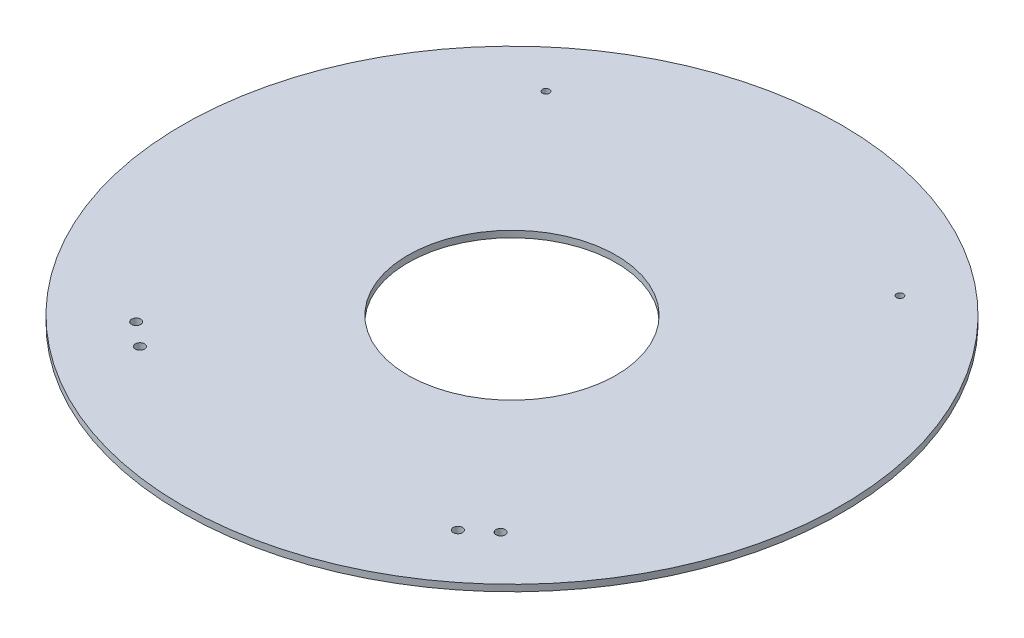
ISO-10303-21;
HEADER;
FILE_DESCRIPTION(('STEP AP214'),'2;1');
FILE_NAME('part.step','',(''),(''),'','','');
FILE_SCHEMA(('AUTOMOTIVE_DESIGN { 1 0 10303 214 1 1 1 1 }'));
ENDSEC;
DATA;
#1=APPLICATION_CONTEXT('core data for automotive mechanical design processes');
#2=APPLICATION_PROTOCOL_DEFINITION('international standard','automotive_design',2000,#1);
#3=PRODUCT_CONTEXT('',#1,'mechanical');
#4=PRODUCT('Part','Part','',(#3));
#5=PRODUCT_RELATED_PRODUCT_CATEGORY('part','',(#4));
#6=PRODUCT_DEFINITION_FORMATION('','',#4);
#7=PRODUCT_DEFINITION_CONTEXT('part definition',#1,'design');
#8=PRODUCT_DEFINITION('design','',#6,#7);
#9=PRODUCT_DEFINITION_SHAPE('','',#8);
#10=(LENGTH_UNIT() NAMED_UNIT(*) SI_UNIT(.MILLI.,.METRE.));
#11=(NAMED_UNIT(*) PLANE_ANGLE_UNIT() SI_UNIT($,.RADIAN.));
#12=(NAMED_UNIT(*) SI_UNIT($,.STERADIAN.) SOLID_ANGLE_UNIT());
#13=UNCERTAINTY_MEASURE_WITH_UNIT(LENGTH_MEASURE(1.E-05),#10,'distance_accuracy_value','');
#14=(GEOMETRIC_REPRESENTATION_CONTEXT(3) GLOBAL_UNCERTAINTY_ASSIGNED_CONTEXT((#13)) GLOBAL_UNIT_ASSIGNED_CONTEXT((#10,
#11,#12)) REPRESENTATION_CONTEXT('',''));
#15=CARTESIAN_POINT('',(0.,0.,0.));
#16=DIRECTION('',(0.,0.,1.));
#17=DIRECTION('',(1.,0.,0.));
#18=AXIS2_PLACEMENT_3D('',#15,#16,#17);
#19=CARTESIAN_POINT('',(0.,4.7625,0.));
#20=DIRECTION('',(0.,1.,0.));
#21=DIRECTION('',(0.,0.,1.));
#22=AXIS2_PLACEMENT_3D('',#19,#20,#21);
#23=PLANE('',#22);
#24=CARTESIAN_POINT('',(129.594016957928,4.7625,-154.444135288325));
#25=DIRECTION('',(0.,-1.,0.));
#26=DIRECTION('',(0.,0.,-1.));
#27=AXIS2_PLACEMENT_3D('',#24,#25,#26);
#28=CIRCLE('',#27,2.55269999999999);
#29=CARTESIAN_POINT('',(129.594016957928,4.7625,-156.996835288325));
#30=VERTEX_POINT('',#29);
#31=EDGE_CURVE('E97',#30,#30,#28,.T.);
#32=ORIENTED_EDGE('',*,*,#31,.T.);
#33=EDGE_LOOP('',(#32));
#34=FACE_BOUND('',#33,.T.);
#35=CARTESIAN_POINT('',(0.,4.7625,0.));
#36=DIRECTION('',(0.,1.,0.));
#37=DIRECTION('',(0.,0.,1.));
#38=AXIS2_PLACEMENT_3D('',#35,#36,#37);
#39=CIRCLE('',#38,76.2);
#40=CARTESIAN_POINT('',(0.,4.7625,76.2));
#41=VERTEX_POINT('',#40);
#42=EDGE_CURVE('E60',#41,#41,#39,.T.);
#43=ORIENTED_EDGE('',*,*,#42,.F.);
#44=EDGE_LOOP('',(#43));
#45=FACE_BOUND('',#44,.T.);
#46=CARTESIAN_POINT('',(0.,4.7625,0.));
#47=DIRECTION('',(0.,1.,0.));
#48=DIRECTION('',(0.,0.,1.));
#49=AXIS2_PLACEMENT_3D('',#46,#47,#48);
#50=CIRCLE('',#49,241.3);
#51=CARTESIAN_POINT('',(0.,4.7625,241.3));
#52=VERTEX_POINT('',#51);
#53=EDGE_CURVE('E12',#52,#52,#50,.T.);
#54=ORIENTED_EDGE('',*,*,#53,.T.);
#55=EDGE_LOOP('',(#54));
#56=FACE_BOUND('',#55,.T.);
#57=CARTESIAN_POINT('',(-133.426417094913,4.7625,141.723430893849));
#58=DIRECTION('',(0.,-1.,0.));
#59=DIRECTION('',(0.,0.,-1.));
#60=AXIS2_PLACEMENT_3D('',#57,#58,#59);
#61=CIRCLE('',#60,3.3782);
#62=CARTESIAN_POINT('',(-133.426417094913,4.7625,138.345230893849));
#63=VERTEX_POINT('',#62);
#64=EDGE_CURVE('E65',#63,#63,#61,.T.);
#65=ORIENTED_EDGE('',*,*,#64,.T.);
#66=EDGE_LOOP('',(#65));
#67=FACE_BOUND('',#66,.T.);
#68=CARTESIAN_POINT('',(-116.401079346594,4.7625,156.009385519133));
#69=DIRECTION('',(0.,-1.,0.));
#70=DIRECTION('',(0.,0.,-1.));
#71=AXIS2_PLACEMENT_3D('',#68,#69,#70);
#72=CIRCLE('',#71,3.3782);
#73=CARTESIAN_POINT('',(-116.401079346594,4.7625,152.631185519133));
#74=VERTEX_POINT('',#73);
#75=EDGE_CURVE('E73',#74,#74,#72,.T.);
#76=ORIENTED_EDGE('',*,*,#75,.T.);
#77=EDGE_LOOP('',(#76));
#78=FACE_BOUND('',#77,.T.);
#79=CARTESIAN_POINT('',(116.401079346594,4.7625,156.009385519133));
#80=DIRECTION('',(0.,-1.,0.));
#81=DIRECTION('',(0.,0.,-1.));
#82=AXIS2_PLACEMENT_3D('',#79,#80,#81);
#83=CIRCLE('',#82,3.3782);
#84=CARTESIAN_POINT('',(116.401079346594,4.7625,152.631185519133));
#85=VERTEX_POINT('',#84);
#86=EDGE_CURVE('E79',#85,#85,#83,.T.);
#87=ORIENTED_EDGE('',*,*,#86,.T.);
#88=EDGE_LOOP('',(#87));
#89=FACE_BOUND('',#88,.T.);
#90=CARTESIAN_POINT('',(133.426417094913,4.7625,141.723430893849));
#91=DIRECTION('',(0.,-1.,0.));
#92=DIRECTION('',(0.,0.,-1.));
#93=AXIS2_PLACEMENT_3D('',#90,#91,#92);
#94=CIRCLE('',#93,3.3782);
#95=CARTESIAN_POINT('',(133.426417094913,4.7625,138.345230893849));
#96=VERTEX_POINT('',#95);
#97=EDGE_CURVE('E85',#96,#96,#94,.T.);
#98=ORIENTED_EDGE('',*,*,#97,.T.);
#99=EDGE_LOOP('',(#98));
#100=FACE_BOUND('',#99,.T.);
#101=CARTESIAN_POINT('',(-129.594016957928,4.7625,-154.444135288325));
#102=DIRECTION('',(0.,-1.,0.));
#103=DIRECTION('',(0.,0.,-1.));
#104=AXIS2_PLACEMENT_3D('',#101,#102,#103);
#105=CIRCLE('',#104,2.55269999999999);
#106=CARTESIAN_POINT('',(-129.594016957928,4.7625,-156.996835288325));
#107=VERTEX_POINT('',#106);
#108=EDGE_CURVE('E91',#107,#107,#105,.T.);
#109=ORIENTED_EDGE('',*,*,#108,.T.);
#110=EDGE_LOOP('',(#109));
#111=FACE_BOUND('',#110,.T.);
#112=ADVANCED_FACE('F49',(#34,#45,#56,#67,#78,#89,#100,#111),#23,.T.);
#113=CARTESIAN_POINT('',(0.,0.,0.));
#114=DIRECTION('',(0.,1.,0.));
#115=DIRECTION('',(0.,0.,1.));
#116=AXIS2_PLACEMENT_3D('',#113,#114,#115);
#117=PLANE('',#116);
#118=CARTESIAN_POINT('',(129.594016957928,0.,-154.444135288325));
#119=DIRECTION('',(0.,-1.,0.));
#120=DIRECTION('',(0.,0.,-1.));
#121=AXIS2_PLACEMENT_3D('',#118,#119,#120);
#122=CIRCLE('',#121,2.55269999999999);
#123=CARTESIAN_POINT('',(129.594016957928,0.,-156.996835288325));
#124=VERTEX_POINT('',#123);
#125=EDGE_CURVE('E100',#124,#124,#122,.T.);
#126=ORIENTED_EDGE('',*,*,#125,.F.);
#127=EDGE_LOOP('',(#126));
#128=FACE_BOUND('',#127,.T.);
#129=CARTESIAN_POINT('',(-129.594016957928,0.,-154.444135288325));
#130=DIRECTION('',(0.,-1.,0.));
#131=DIRECTION('',(0.,0.,-1.));
#132=AXIS2_PLACEMENT_3D('',#129,#130,#131);
#133=CIRCLE('',#132,2.55269999999999);
#134=CARTESIAN_POINT('',(-129.594016957928,0.,-156.996835288325));
#135=VERTEX_POINT('',#134);
#136=EDGE_CURVE('E94',#135,#135,#133,.T.);
#137=ORIENTED_EDGE('',*,*,#136,.F.);
#138=EDGE_LOOP('',(#137));
#139=FACE_BOUND('',#138,.T.);
#140=CARTESIAN_POINT('',(133.426417094913,0.,141.723430893849));
#141=DIRECTION('',(0.,-1.,0.));
#142=DIRECTION('',(0.,0.,-1.));
#143=AXIS2_PLACEMENT_3D('',#140,#141,#142);
#144=CIRCLE('',#143,3.3782);
#145=CARTESIAN_POINT('',(133.426417094913,0.,138.345230893849));
#146=VERTEX_POINT('',#145);
#147=EDGE_CURVE('E88',#146,#146,#144,.T.);
#148=ORIENTED_EDGE('',*,*,#147,.F.);
#149=EDGE_LOOP('',(#148));
#150=FACE_BOUND('',#149,.T.);
#151=CARTESIAN_POINT('',(-116.401079346594,0.,156.009385519133));
#152=DIRECTION('',(0.,-1.,0.));
#153=DIRECTION('',(0.,0.,-1.));
#154=AXIS2_PLACEMENT_3D('',#151,#152,#153);
#155=CIRCLE('',#154,3.3782);
#156=CARTESIAN_POINT('',(-116.401079346594,0.,152.631185519133));
#157=VERTEX_POINT('',#156);
#158=EDGE_CURVE('E76',#157,#157,#155,.T.);
#159=ORIENTED_EDGE('',*,*,#158,.F.);
#160=EDGE_LOOP('',(#159));
#161=FACE_BOUND('',#160,.T.);
#162=CARTESIAN_POINT('',(-133.426417094913,0.,141.723430893849));
#163=DIRECTION('',(0.,-1.,0.));
#164=DIRECTION('',(0.,0.,-1.));
#165=AXIS2_PLACEMENT_3D('',#162,#163,#164);
#166=CIRCLE('',#165,3.3782);
#167=CARTESIAN_POINT('',(-133.426417094913,0.,138.345230893849));
#168=VERTEX_POINT('',#167);
#169=EDGE_CURVE('E70',#168,#168,#166,.T.);
#170=ORIENTED_EDGE('',*,*,#169,.F.);
#171=EDGE_LOOP('',(#170));
#172=FACE_BOUND('',#171,.T.);
#173=CARTESIAN_POINT('',(0.,0.,0.));
#174=DIRECTION('',(0.,1.,0.));
#175=DIRECTION('',(0.,0.,1.));
#176=AXIS2_PLACEMENT_3D('',#173,#174,#175);
#177=CIRCLE('',#176,241.3);
#178=CARTESIAN_POINT('',(0.,0.,241.3));
#179=VERTEX_POINT('',#178);
#180=EDGE_CURVE('E53',#179,#179,#177,.T.);
#181=ORIENTED_EDGE('',*,*,#180,.F.);
#182=EDGE_LOOP('',(#181));
#183=FACE_BOUND('',#182,.T.);
#184=CARTESIAN_POINT('',(0.,0.,0.));
#185=DIRECTION('',(0.,1.,0.));
#186=DIRECTION('',(0.,0.,1.));
#187=AXIS2_PLACEMENT_3D('',#184,#185,#186);
#188=CIRCLE('',#187,76.2);
#189=CARTESIAN_POINT('',(0.,0.,76.2));
#190=VERTEX_POINT('',#189);
#191=EDGE_CURVE('E62',#190,#190,#188,.T.);
#192=ORIENTED_EDGE('',*,*,#191,.T.);
#193=EDGE_LOOP('',(#192));
#194=FACE_BOUND('',#193,.T.);
#195=CARTESIAN_POINT('',(116.401079346594,0.,156.009385519133));
#196=DIRECTION('',(0.,-1.,0.));
#197=DIRECTION('',(0.,0.,-1.));
#198=AXIS2_PLACEMENT_3D('',#195,#196,#197);
#199=CIRCLE('',#198,3.3782);
#200=CARTESIAN_POINT('',(116.401079346594,0.,152.631185519133));
#201=VERTEX_POINT('',#200);
#202=EDGE_CURVE('E82',#201,#201,#199,.T.);
#203=ORIENTED_EDGE('',*,*,#202,.F.);
#204=EDGE_LOOP('',(#203));
#205=FACE_BOUND('',#204,.T.);
#206=ADVANCED_FACE('F106',(#128,#139,#150,#161,#172,#183,#194,#205),#117,.F.);
#207=CARTESIAN_POINT('',(0.,4.7625,0.));
#208=DIRECTION('',(0.,-1.,0.));
#209=DIRECTION('',(0.,0.,-1.));
#210=AXIS2_PLACEMENT_3D('',#207,#208,#209);
#211=CYLINDRICAL_SURFACE('',#210,241.3);
#212=ORIENTED_EDGE('',*,*,#53,.F.);
#213=EDGE_LOOP('',(#212));
#214=FACE_BOUND('',#213,.T.);
#215=ORIENTED_EDGE('',*,*,#180,.T.);
#216=EDGE_LOOP('',(#215));
#217=FACE_BOUND('',#216,.T.);
#218=ADVANCED_FACE('F51',(#214,#217),#211,.T.);
#219=CARTESIAN_POINT('',(0.,4.7625,0.));
#220=DIRECTION('',(0.,-1.,0.));
#221=DIRECTION('',(0.,0.,-1.));
#222=AXIS2_PLACEMENT_3D('',#219,#220,#221);
#223=CYLINDRICAL_SURFACE('',#222,76.2);
#224=ORIENTED_EDGE('',*,*,#42,.T.);
#225=EDGE_LOOP('',(#224));
#226=FACE_BOUND('',#225,.T.);
#227=ORIENTED_EDGE('',*,*,#191,.F.);
#228=EDGE_LOOP('',(#227));
#229=FACE_BOUND('',#228,.T.);
#230=ADVANCED_FACE('F147',(#226,#229),#223,.F.);
#231=CARTESIAN_POINT('',(-133.426417094913,0.,141.723430893849));
#232=DIRECTION('',(0.,-1.,0.));
#233=DIRECTION('',(0.,0.,-1.));
#234=AXIS2_PLACEMENT_3D('',#231,#232,#233);
#235=CYLINDRICAL_SURFACE('',#234,3.3782);
#236=ORIENTED_EDGE('',*,*,#64,.F.);
#237=EDGE_LOOP('',(#236));
#238=FACE_BOUND('',#237,.T.);
#239=ORIENTED_EDGE('',*,*,#169,.T.);
#240=EDGE_LOOP('',(#239));
#241=FACE_BOUND('',#240,.T.);
#242=ADVANCED_FACE('F136',(#238,#241),#235,.F.);
#243=CARTESIAN_POINT('',(-116.401079346594,0.,156.009385519133));
#244=DIRECTION('',(0.,-1.,0.));
#245=DIRECTION('',(0.,0.,-1.));
#246=AXIS2_PLACEMENT_3D('',#243,#244,#245);
#247=CYLINDRICAL_SURFACE('',#246,3.3782);
#248=ORIENTED_EDGE('',*,*,#75,.F.);
#249=EDGE_LOOP('',(#248));
#250=FACE_BOUND('',#249,.T.);
#251=ORIENTED_EDGE('',*,*,#158,.T.);
#252=EDGE_LOOP('',(#251));
#253=FACE_BOUND('',#252,.T.);
#254=ADVANCED_FACE('F126',(#250,#253),#247,.F.);
#255=CARTESIAN_POINT('',(116.401079346594,0.,156.009385519133));
#256=DIRECTION('',(0.,-1.,0.));
#257=DIRECTION('',(0.,0.,-1.));
#258=AXIS2_PLACEMENT_3D('',#255,#256,#257);
#259=CYLINDRICAL_SURFACE('',#258,3.3782);
#260=ORIENTED_EDGE('',*,*,#86,.F.);
#261=EDGE_LOOP('',(#260));
#262=FACE_BOUND('',#261,.T.);
#263=ORIENTED_EDGE('',*,*,#202,.T.);
#264=EDGE_LOOP('',(#263));
#265=FACE_BOUND('',#264,.T.);
#266=ADVANCED_FACE('F123',(#262,#265),#259,.F.);
#267=CARTESIAN_POINT('',(133.426417094913,0.,141.723430893849));
#268=DIRECTION('',(0.,-1.,0.));
#269=DIRECTION('',(0.,0.,-1.));
#270=AXIS2_PLACEMENT_3D('',#267,#268,#269);
#271=CYLINDRICAL_SURFACE('',#270,3.3782);
#272=ORIENTED_EDGE('',*,*,#97,.F.);
#273=EDGE_LOOP('',(#272));
#274=FACE_BOUND('',#273,.T.);
#275=ORIENTED_EDGE('',*,*,#147,.T.);
#276=EDGE_LOOP('',(#275));
#277=FACE_BOUND('',#276,.T.);
#278=ADVANCED_FACE('F125',(#274,#277),#271,.F.);
#279=CARTESIAN_POINT('',(-129.594016957928,0.,-154.444135288325));
#280=DIRECTION('',(0.,-1.,0.));
#281=DIRECTION('',(0.,0.,-1.));
#282=AXIS2_PLACEMENT_3D('',#279,#280,#281);
#283=CYLINDRICAL_SURFACE('',#282,2.55269999999999);
#284=ORIENTED_EDGE('',*,*,#108,.F.);
#285=EDGE_LOOP('',(#284));
#286=FACE_BOUND('',#285,.T.);
#287=ORIENTED_EDGE('',*,*,#136,.T.);
#288=EDGE_LOOP('',(#287));
#289=FACE_BOUND('',#288,.T.);
#290=ADVANCED_FACE('F133',(#286,#289),#283,.F.);
#291=CARTESIAN_POINT('',(129.594016957928,0.,-154.444135288325));
#292=DIRECTION('',(0.,-1.,0.));
#293=DIRECTION('',(0.,0.,-1.));
#294=AXIS2_PLACEMENT_3D('',#291,#292,#293);
#295=CYLINDRICAL_SURFACE('',#294,2.55269999999999);
#296=ORIENTED_EDGE('',*,*,#31,.F.);
#297=EDGE_LOOP('',(#296));
#298=FACE_BOUND('',#297,.T.);
#299=ORIENTED_EDGE('',*,*,#125,.T.);
#300=EDGE_LOOP('',(#299));
#301=FACE_BOUND('',#300,.T.);
#302=ADVANCED_FACE('F104',(#298,#301),#295,.F.);
#303=CLOSED_SHELL('',(#112,#206,#218,#230,#242,#254,#266,#278,#290,#302));
#304=MANIFOLD_SOLID_BREP('B2',#303);
#305=ADVANCED_BREP_SHAPE_REPRESENTATION('',(#18,#304),#14);
#306=SHAPE_DEFINITION_REPRESENTATION(#9,#305);
ENDSEC;
END-ISO-10303-21;
